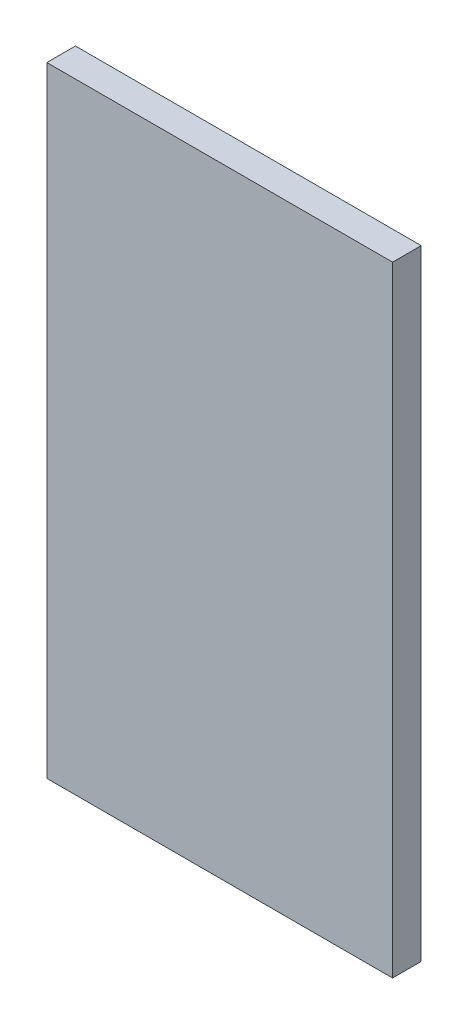
ISO-10303-21;
HEADER;
FILE_DESCRIPTION(('STEP AP214'),'2;1');
FILE_NAME('part.step','',(''),(''),'','','');
FILE_SCHEMA(('AUTOMOTIVE_DESIGN { 1 0 10303 214 1 1 1 1 }'));
ENDSEC;
DATA;
#1=APPLICATION_CONTEXT('core data for automotive mechanical design processes');
#2=APPLICATION_PROTOCOL_DEFINITION('international standard','automotive_design',2000,#1);
#3=PRODUCT_CONTEXT('',#1,'mechanical');
#4=PRODUCT('Part','Part','',(#3));
#5=PRODUCT_RELATED_PRODUCT_CATEGORY('part','',(#4));
#6=PRODUCT_DEFINITION_FORMATION('','',#4);
#7=PRODUCT_DEFINITION_CONTEXT('part definition',#1,'design');
#8=PRODUCT_DEFINITION('design','',#6,#7);
#9=PRODUCT_DEFINITION_SHAPE('','',#8);
#10=(LENGTH_UNIT() NAMED_UNIT(*) SI_UNIT(.MILLI.,.METRE.));
#11=(NAMED_UNIT(*) PLANE_ANGLE_UNIT() SI_UNIT($,.RADIAN.));
#12=(NAMED_UNIT(*) SI_UNIT($,.STERADIAN.) SOLID_ANGLE_UNIT());
#13=UNCERTAINTY_MEASURE_WITH_UNIT(LENGTH_MEASURE(1.E-05),#10,'distance_accuracy_value','');
#14=(GEOMETRIC_REPRESENTATION_CONTEXT(3) GLOBAL_UNCERTAINTY_ASSIGNED_CONTEXT((#13)) GLOBAL_UNIT_ASSIGNED_CONTEXT((#10,
#11,#12)) REPRESENTATION_CONTEXT('',''));
#15=CARTESIAN_POINT('',(0.,0.,0.));
#16=DIRECTION('',(0.,0.,1.));
#17=DIRECTION('',(1.,0.,0.));
#18=AXIS2_PLACEMENT_3D('',#15,#16,#17);
#19=CARTESIAN_POINT('',(-10.0658943507042,33.6236969127041,0.762000000000082));
#20=DIRECTION('',(-1.,0.,0.));
#21=DIRECTION('',(0.,-1.00000000000001,0.));
#22=AXIS2_PLACEMENT_3D('',#19,#20,#21);
#23=PLANE('',#22);
#24=DIRECTION('',(0.,1.00000000000001,0.));
#25=VECTOR('',#24,1.);
#26=CARTESIAN_POINT('',(-10.0658943507042,33.6236969127041,0.));
#27=LINE('',#26,#25);
#28=CARTESIAN_POINT('',(-10.0658943507042,33.6236969127041,0.));
#29=VERTEX_POINT('',#28);
#30=CARTESIAN_POINT('',(-10.0658943507042,50.1336969127042,1.2490009027033E-13));
#31=VERTEX_POINT('',#30);
#32=EDGE_CURVE('E98',#29,#31,#27,.T.);
#33=ORIENTED_EDGE('',*,*,#32,.T.);
#34=DIRECTION('',(0.,0.,-1.));
#35=VECTOR('',#34,1.);
#36=CARTESIAN_POINT('',(-10.0658943507042,50.1336969127042,0.762000000000125));
#37=LINE('',#36,#35);
#38=CARTESIAN_POINT('',(-10.0658943507042,50.1336969127042,0.762000000000125));
#39=VERTEX_POINT('',#38);
#40=EDGE_CURVE('E11',#39,#31,#37,.T.);
#41=ORIENTED_EDGE('',*,*,#40,.F.);
#42=DIRECTION('',(0.,1.00000000000001,0.));
#43=VECTOR('',#42,1.);
#44=CARTESIAN_POINT('',(-10.0658943507042,33.6236969127041,0.762000000000082));
#45=LINE('',#44,#43);
#46=CARTESIAN_POINT('',(-10.0658943507042,33.6236969127041,0.762000000000082));
#47=VERTEX_POINT('',#46);
#48=EDGE_CURVE('E86',#47,#39,#45,.T.);
#49=ORIENTED_EDGE('',*,*,#48,.F.);
#50=DIRECTION('',(0.,0.,-1.));
#51=VECTOR('',#50,1.);
#52=CARTESIAN_POINT('',(-10.0658943507042,33.6236969127041,0.762000000000082));
#53=LINE('',#52,#51);
#54=EDGE_CURVE('E94',#47,#29,#53,.T.);
#55=ORIENTED_EDGE('',*,*,#54,.T.);
#56=EDGE_LOOP('',(#33,#41,#49,#55));
#57=FACE_BOUND('',#56,.T.);
#58=ADVANCED_FACE('F35',(#57),#23,.F.);
#59=CARTESIAN_POINT('',(-10.0658943507042,50.1336969127042,0.762000000000125));
#60=DIRECTION('',(0.,-1.00000000000001,0.));
#61=DIRECTION('',(0.,0.,-1.));
#62=AXIS2_PLACEMENT_3D('',#59,#60,#61);
#63=PLANE('',#62);
#64=DIRECTION('',(-1.,0.,0.));
#65=VECTOR('',#64,1.);
#66=CARTESIAN_POINT('',(-10.0658943507042,50.1336969127042,1.2490009027033E-13));
#67=LINE('',#66,#65);
#68=CARTESIAN_POINT('',(-19.2733943507041,50.1336969127042,1.2490009027033E-13));
#69=VERTEX_POINT('',#68);
#70=EDGE_CURVE('E90',#31,#69,#67,.T.);
#71=ORIENTED_EDGE('',*,*,#70,.T.);
#72=DIRECTION('',(0.,0.,-1.));
#73=VECTOR('',#72,1.);
#74=CARTESIAN_POINT('',(-19.2733943507041,50.1336969127042,0.762000000000124));
#75=LINE('',#74,#73);
#76=CARTESIAN_POINT('',(-19.2733943507041,50.1336969127042,0.762000000000124));
#77=VERTEX_POINT('',#76);
#78=EDGE_CURVE('E43',#77,#69,#75,.T.);
#79=ORIENTED_EDGE('',*,*,#78,.F.);
#80=DIRECTION('',(-1.,0.,0.));
#81=VECTOR('',#80,1.);
#82=CARTESIAN_POINT('',(-10.0658943507042,50.1336969127042,0.762000000000125));
#83=LINE('',#82,#81);
#84=EDGE_CURVE('E81',#39,#77,#83,.T.);
#85=ORIENTED_EDGE('',*,*,#84,.F.);
#86=ORIENTED_EDGE('',*,*,#40,.T.);
#87=EDGE_LOOP('',(#71,#79,#85,#86));
#88=FACE_BOUND('',#87,.T.);
#89=ADVANCED_FACE('F89',(#88),#63,.F.);
#90=CARTESIAN_POINT('',(-19.2733943507041,50.1336969127042,0.762000000000124));
#91=DIRECTION('',(1.,0.,0.));
#92=DIRECTION('',(0.,0.,-1.));
#93=AXIS2_PLACEMENT_3D('',#90,#91,#92);
#94=PLANE('',#93);
#95=DIRECTION('',(0.,-1.00000000000001,0.));
#96=VECTOR('',#95,1.);
#97=CARTESIAN_POINT('',(-19.2733943507041,50.1336969127042,1.2490009027033E-13));
#98=LINE('',#97,#96);
#99=CARTESIAN_POINT('',(-19.2733943507042,33.6236969127041,0.));
#100=VERTEX_POINT('',#99);
#101=EDGE_CURVE('E68',#69,#100,#98,.T.);
#102=ORIENTED_EDGE('',*,*,#101,.T.);
#103=DIRECTION('',(0.,0.,-1.));
#104=VECTOR('',#103,1.);
#105=CARTESIAN_POINT('',(-19.2733943507042,33.6236969127041,0.762000000000068));
#106=LINE('',#105,#104);
#107=CARTESIAN_POINT('',(-19.2733943507042,33.6236969127041,0.762000000000068));
#108=VERTEX_POINT('',#107);
#109=EDGE_CURVE('E91',#108,#100,#106,.T.);
#110=ORIENTED_EDGE('',*,*,#109,.F.);
#111=DIRECTION('',(0.,-1.00000000000001,0.));
#112=VECTOR('',#111,1.);
#113=CARTESIAN_POINT('',(-19.2733943507041,50.1336969127042,0.762000000000124));
#114=LINE('',#113,#112);
#115=EDGE_CURVE('E84',#77,#108,#114,.T.);
#116=ORIENTED_EDGE('',*,*,#115,.F.);
#117=ORIENTED_EDGE('',*,*,#78,.T.);
#118=EDGE_LOOP('',(#102,#110,#116,#117));
#119=FACE_BOUND('',#118,.T.);
#120=ADVANCED_FACE('F92',(#119),#94,.F.);
#121=CARTESIAN_POINT('',(-19.2733943507042,33.6236969127041,0.762000000000068));
#122=DIRECTION('',(0.,1.00000000000001,0.));
#123=DIRECTION('',(0.,0.,1.));
#124=AXIS2_PLACEMENT_3D('',#121,#122,#123);
#125=PLANE('',#124);
#126=DIRECTION('',(1.,0.,0.));
#127=VECTOR('',#126,1.);
#128=CARTESIAN_POINT('',(-19.2733943507042,33.6236969127041,0.));
#129=LINE('',#128,#127);
#130=EDGE_CURVE('E74',#100,#29,#129,.T.);
#131=ORIENTED_EDGE('',*,*,#130,.T.);
#132=ORIENTED_EDGE('',*,*,#54,.F.);
#133=DIRECTION('',(1.,0.,0.));
#134=VECTOR('',#133,1.);
#135=CARTESIAN_POINT('',(-19.2733943507042,33.6236969127041,0.762000000000068));
#136=LINE('',#135,#134);
#137=EDGE_CURVE('E51',#108,#47,#136,.T.);
#138=ORIENTED_EDGE('',*,*,#137,.F.);
#139=ORIENTED_EDGE('',*,*,#109,.T.);
#140=EDGE_LOOP('',(#131,#132,#138,#139));
#141=FACE_BOUND('',#140,.T.);
#142=ADVANCED_FACE('F105',(#141),#125,.F.);
#143=CARTESIAN_POINT('',(0.,0.,0.761999999999999));
#144=DIRECTION('',(0.,0.,1.));
#145=DIRECTION('',(1.,0.,0.));
#146=AXIS2_PLACEMENT_3D('',#143,#144,#145);
#147=PLANE('',#146);
#148=ORIENTED_EDGE('',*,*,#48,.T.);
#149=ORIENTED_EDGE('',*,*,#84,.T.);
#150=ORIENTED_EDGE('',*,*,#115,.T.);
#151=ORIENTED_EDGE('',*,*,#137,.T.);
#152=EDGE_LOOP('',(#148,#149,#150,#151));
#153=FACE_BOUND('',#152,.T.);
#154=ADVANCED_FACE('F82',(#153),#147,.T.);
#155=CARTESIAN_POINT('',(0.,0.,0.));
#156=DIRECTION('',(0.,0.,1.));
#157=DIRECTION('',(1.,0.,0.));
#158=AXIS2_PLACEMENT_3D('',#155,#156,#157);
#159=PLANE('',#158);
#160=ORIENTED_EDGE('',*,*,#32,.F.);
#161=ORIENTED_EDGE('',*,*,#130,.F.);
#162=ORIENTED_EDGE('',*,*,#101,.F.);
#163=ORIENTED_EDGE('',*,*,#70,.F.);
#164=EDGE_LOOP('',(#160,#161,#162,#163));
#165=FACE_BOUND('',#164,.T.);
#166=ADVANCED_FACE('F108',(#165),#159,.F.);
#167=CLOSED_SHELL('',(#58,#89,#120,#142,#154,#166));
#168=MANIFOLD_SOLID_BREP('B2',#167);
#169=ADVANCED_BREP_SHAPE_REPRESENTATION('',(#18,#168),#14);
#170=SHAPE_DEFINITION_REPRESENTATION(#9,#169);
ENDSEC;
END-ISO-10303-21;
